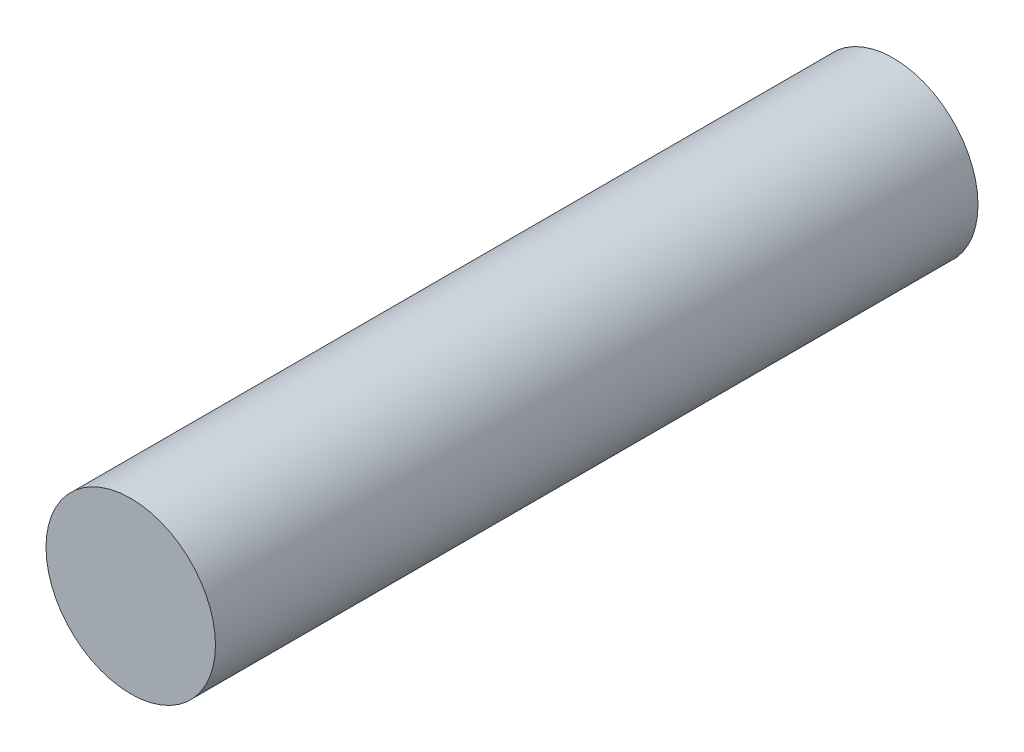
ISO-10303-21;
HEADER;
FILE_DESCRIPTION(('STEP AP214'),'2;1');
FILE_NAME('part.step','',(''),(''),'','','');
FILE_SCHEMA(('AUTOMOTIVE_DESIGN { 1 0 10303 214 1 1 1 1 }'));
ENDSEC;
DATA;
#1=APPLICATION_CONTEXT('core data for automotive mechanical design processes');
#2=APPLICATION_PROTOCOL_DEFINITION('international standard','automotive_design',2000,#1);
#3=PRODUCT_CONTEXT('',#1,'mechanical');
#4=PRODUCT('Part','Part','',(#3));
#5=PRODUCT_RELATED_PRODUCT_CATEGORY('part','',(#4));
#6=PRODUCT_DEFINITION_FORMATION('','',#4);
#7=PRODUCT_DEFINITION_CONTEXT('part definition',#1,'design');
#8=PRODUCT_DEFINITION('design','',#6,#7);
#9=PRODUCT_DEFINITION_SHAPE('','',#8);
#10=(LENGTH_UNIT() NAMED_UNIT(*) SI_UNIT(.MILLI.,.METRE.));
#11=(NAMED_UNIT(*) PLANE_ANGLE_UNIT() SI_UNIT($,.RADIAN.));
#12=(NAMED_UNIT(*) SI_UNIT($,.STERADIAN.) SOLID_ANGLE_UNIT());
#13=UNCERTAINTY_MEASURE_WITH_UNIT(LENGTH_MEASURE(1.E-05),#10,'distance_accuracy_value','');
#14=(GEOMETRIC_REPRESENTATION_CONTEXT(3) GLOBAL_UNCERTAINTY_ASSIGNED_CONTEXT((#13)) GLOBAL_UNIT_ASSIGNED_CONTEXT((#10,
#11,#12)) REPRESENTATION_CONTEXT('',''));
#15=CARTESIAN_POINT('',(0.,0.,0.));
#16=DIRECTION('',(0.,0.,1.));
#17=DIRECTION('',(1.,0.,0.));
#18=AXIS2_PLACEMENT_3D('',#15,#16,#17);
#19=CARTESIAN_POINT('',(0.,0.,14.2875));
#20=DIRECTION('',(0.,0.,-1.));
#21=DIRECTION('',(-1.,0.,0.));
#22=AXIS2_PLACEMENT_3D('',#19,#20,#21);
#23=CYLINDRICAL_SURFACE('',#22,3.175);
#24=CARTESIAN_POINT('',(0.,0.,14.2875));
#25=DIRECTION('',(0.,0.,1.));
#26=DIRECTION('',(1.,0.,0.));
#27=AXIS2_PLACEMENT_3D('',#24,#25,#26);
#28=CIRCLE('',#27,3.175);
#29=CARTESIAN_POINT('',(3.175,0.,14.2875));
#30=VERTEX_POINT('',#29);
#31=EDGE_CURVE('E10',#30,#30,#28,.T.);
#32=ORIENTED_EDGE('',*,*,#31,.F.);
#33=EDGE_LOOP('',(#32));
#34=FACE_BOUND('',#33,.T.);
#35=CARTESIAN_POINT('',(0.,0.,-14.2875));
#36=DIRECTION('',(0.,0.,1.));
#37=DIRECTION('',(1.,0.,0.));
#38=AXIS2_PLACEMENT_3D('',#35,#36,#37);
#39=CIRCLE('',#38,3.175);
#40=CARTESIAN_POINT('',(3.175,0.,-14.2875));
#41=VERTEX_POINT('',#40);
#42=EDGE_CURVE('E34',#41,#41,#39,.T.);
#43=ORIENTED_EDGE('',*,*,#42,.T.);
#44=EDGE_LOOP('',(#43));
#45=FACE_BOUND('',#44,.T.);
#46=ADVANCED_FACE('F31',(#34,#45),#23,.T.);
#47=CARTESIAN_POINT('',(0.,0.,14.2875));
#48=DIRECTION('',(0.,0.,1.));
#49=DIRECTION('',(1.,0.,0.));
#50=AXIS2_PLACEMENT_3D('',#47,#48,#49);
#51=PLANE('',#50);
#52=ORIENTED_EDGE('',*,*,#31,.T.);
#53=EDGE_LOOP('',(#52));
#54=FACE_BOUND('',#53,.T.);
#55=ADVANCED_FACE('F46',(#54),#51,.T.);
#56=CARTESIAN_POINT('',(0.,0.,-14.2875));
#57=DIRECTION('',(0.,0.,1.));
#58=DIRECTION('',(1.,0.,0.));
#59=AXIS2_PLACEMENT_3D('',#56,#57,#58);
#60=PLANE('',#59);
#61=ORIENTED_EDGE('',*,*,#42,.F.);
#62=EDGE_LOOP('',(#61));
#63=FACE_BOUND('',#62,.T.);
#64=ADVANCED_FACE('F44',(#63),#60,.F.);
#65=CLOSED_SHELL('',(#46,#55,#64));
#66=MANIFOLD_SOLID_BREP('B2',#65);
#67=ADVANCED_BREP_SHAPE_REPRESENTATION('',(#18,#66),#14);
#68=SHAPE_DEFINITION_REPRESENTATION(#9,#67);
ENDSEC;
END-ISO-10303-21;
